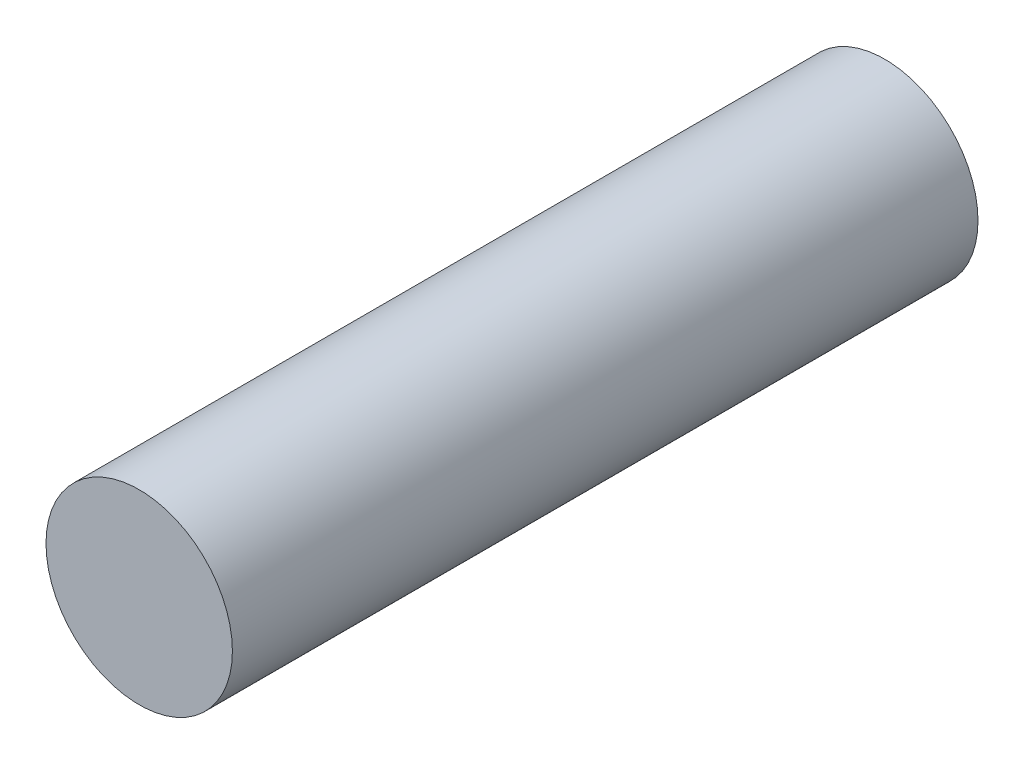
ISO-10303-21;
HEADER;
FILE_DESCRIPTION(('STEP AP214'),'2;1');
FILE_NAME('part.step','',(''),(''),'','','');
FILE_SCHEMA(('AUTOMOTIVE_DESIGN { 1 0 10303 214 1 1 1 1 }'));
ENDSEC;
DATA;
#1=APPLICATION_CONTEXT('core data for automotive mechanical design processes');
#2=APPLICATION_PROTOCOL_DEFINITION('international standard','automotive_design',2000,#1);
#3=PRODUCT_CONTEXT('',#1,'mechanical');
#4=PRODUCT('Part','Part','',(#3));
#5=PRODUCT_RELATED_PRODUCT_CATEGORY('part','',(#4));
#6=PRODUCT_DEFINITION_FORMATION('','',#4);
#7=PRODUCT_DEFINITION_CONTEXT('part definition',#1,'design');
#8=PRODUCT_DEFINITION('design','',#6,#7);
#9=PRODUCT_DEFINITION_SHAPE('','',#8);
#10=(LENGTH_UNIT() NAMED_UNIT(*) SI_UNIT(.MILLI.,.METRE.));
#11=(NAMED_UNIT(*) PLANE_ANGLE_UNIT() SI_UNIT($,.RADIAN.));
#12=(NAMED_UNIT(*) SI_UNIT($,.STERADIAN.) SOLID_ANGLE_UNIT());
#13=UNCERTAINTY_MEASURE_WITH_UNIT(LENGTH_MEASURE(1.E-05),#10,'distance_accuracy_value','');
#14=(GEOMETRIC_REPRESENTATION_CONTEXT(3) GLOBAL_UNCERTAINTY_ASSIGNED_CONTEXT((#13)) GLOBAL_UNIT_ASSIGNED_CONTEXT((#10,
#11,#12)) REPRESENTATION_CONTEXT('',''));
#15=CARTESIAN_POINT('',(0.,0.,0.));
#16=DIRECTION('',(0.,0.,1.));
#17=DIRECTION('',(1.,0.,0.));
#18=AXIS2_PLACEMENT_3D('',#15,#16,#17);
#19=CARTESIAN_POINT('',(0.,-1.38777878078145E-13,38.0999999999999));
#20=DIRECTION('',(0.,0.,-0.999999999999998));
#21=DIRECTION('',(-1.,0.,0.));
#22=AXIS2_PLACEMENT_3D('',#19,#20,#21);
#23=CYLINDRICAL_SURFACE('',#22,4.7625);
#24=CARTESIAN_POINT('',(0.,-1.38777878078145E-13,38.0999999999999));
#25=DIRECTION('',(0.,0.,0.999999999999998));
#26=DIRECTION('',(1.,0.,0.));
#27=AXIS2_PLACEMENT_3D('',#24,#25,#26);
#28=CIRCLE('',#27,4.7625);
#29=CARTESIAN_POINT('',(4.76250000000002,-1.38406105153199E-13,38.0999999999999));
#30=VERTEX_POINT('',#29);
#31=EDGE_CURVE('E12',#30,#30,#28,.T.);
#32=ORIENTED_EDGE('',*,*,#31,.F.);
#33=EDGE_LOOP('',(#32));
#34=FACE_BOUND('',#33,.T.);
#35=CARTESIAN_POINT('',(0.,0.,0.));
#36=DIRECTION('',(0.,0.,0.999999999999998));
#37=DIRECTION('',(1.,0.,0.));
#38=AXIS2_PLACEMENT_3D('',#35,#36,#37);
#39=CIRCLE('',#38,4.7625);
#40=CARTESIAN_POINT('',(4.7625,0.,0.));
#41=VERTEX_POINT('',#40);
#42=EDGE_CURVE('E49',#41,#41,#39,.T.);
#43=ORIENTED_EDGE('',*,*,#42,.T.);
#44=EDGE_LOOP('',(#43));
#45=FACE_BOUND('',#44,.T.);
#46=ADVANCED_FACE('F43',(#34,#45),#23,.T.);
#47=CARTESIAN_POINT('',(0.,-1.38777878078145E-13,38.0999999999999));
#48=DIRECTION('',(0.,0.,0.999999999999998));
#49=DIRECTION('',(1.,0.,0.));
#50=AXIS2_PLACEMENT_3D('',#47,#48,#49);
#51=PLANE('',#50);
#52=ORIENTED_EDGE('',*,*,#31,.T.);
#53=EDGE_LOOP('',(#52));
#54=FACE_BOUND('',#53,.T.);
#55=ADVANCED_FACE('F58',(#54),#51,.T.);
#56=CARTESIAN_POINT('',(0.,0.,0.));
#57=DIRECTION('',(0.,0.,0.999999999999998));
#58=DIRECTION('',(1.,0.,0.));
#59=AXIS2_PLACEMENT_3D('',#56,#57,#58);
#60=PLANE('',#59);
#61=ORIENTED_EDGE('',*,*,#42,.F.);
#62=EDGE_LOOP('',(#61));
#63=FACE_BOUND('',#62,.T.);
#64=ADVANCED_FACE('F56',(#63),#60,.F.);
#65=CLOSED_SHELL('',(#46,#55,#64));
#66=MANIFOLD_SOLID_BREP('B2',#65);
#67=ADVANCED_BREP_SHAPE_REPRESENTATION('',(#18,#66),#14);
#68=SHAPE_DEFINITION_REPRESENTATION(#9,#67);
ENDSEC;
END-ISO-10303-21;
